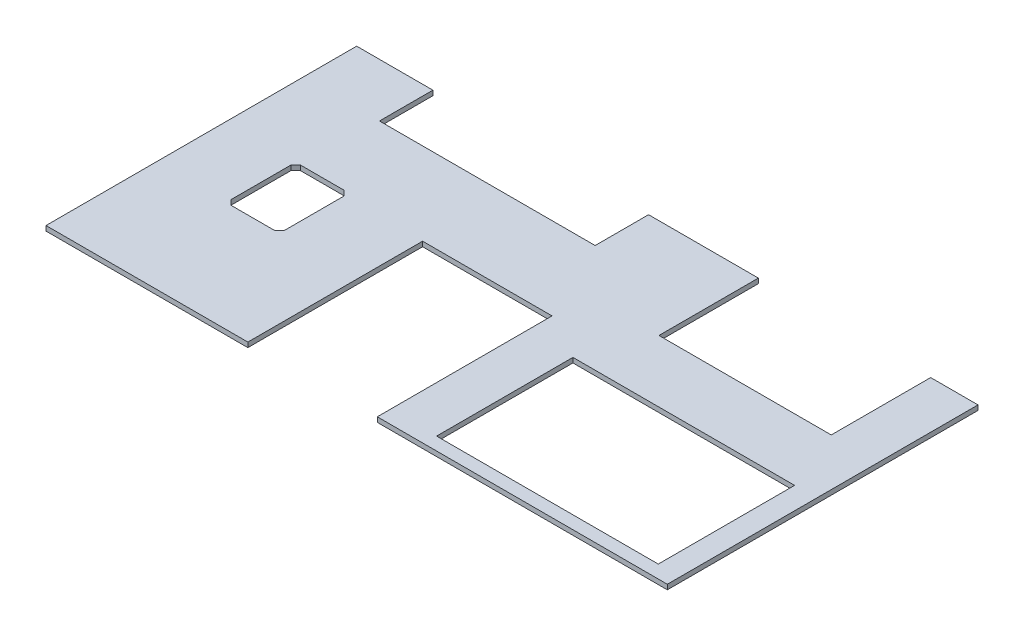
ISO-10303-21;
HEADER;
FILE_DESCRIPTION(('STEP AP214'),'2;1');
FILE_NAME('part.step','',(''),(''),'','','');
FILE_SCHEMA(('AUTOMOTIVE_DESIGN { 1 0 10303 214 1 1 1 1 }'));
ENDSEC;
DATA;
#1=APPLICATION_CONTEXT('core data for automotive mechanical design processes');
#2=APPLICATION_PROTOCOL_DEFINITION('international standard','automotive_design',2000,#1);
#3=PRODUCT_CONTEXT('',#1,'mechanical');
#4=PRODUCT('Part','Part','',(#3));
#5=PRODUCT_RELATED_PRODUCT_CATEGORY('part','',(#4));
#6=PRODUCT_DEFINITION_FORMATION('','',#4);
#7=PRODUCT_DEFINITION_CONTEXT('part definition',#1,'design');
#8=PRODUCT_DEFINITION('design','',#6,#7);
#9=PRODUCT_DEFINITION_SHAPE('','',#8);
#10=(LENGTH_UNIT() NAMED_UNIT(*) SI_UNIT(.MILLI.,.METRE.));
#11=(NAMED_UNIT(*) PLANE_ANGLE_UNIT() SI_UNIT($,.RADIAN.));
#12=(NAMED_UNIT(*) SI_UNIT($,.STERADIAN.) SOLID_ANGLE_UNIT());
#13=UNCERTAINTY_MEASURE_WITH_UNIT(LENGTH_MEASURE(1.E-05),#10,'distance_accuracy_value','');
#14=(GEOMETRIC_REPRESENTATION_CONTEXT(3) GLOBAL_UNCERTAINTY_ASSIGNED_CONTEXT((#13)) GLOBAL_UNIT_ASSIGNED_CONTEXT((#10,
#11,#12)) REPRESENTATION_CONTEXT('',''));
#15=CARTESIAN_POINT('',(0.,0.,0.));
#16=DIRECTION('',(0.,0.,1.));
#17=DIRECTION('',(1.,0.,0.));
#18=AXIS2_PLACEMENT_3D('',#15,#16,#17);
#19=CARTESIAN_POINT('',(2438.4,-19.05,-1219.2));
#20=DIRECTION('',(0.,0.,-1.));
#21=DIRECTION('',(-1.,0.,0.));
#22=AXIS2_PLACEMENT_3D('',#19,#20,#21);
#23=PLANE('',#22);
#24=DIRECTION('',(0.,1.,0.));
#25=VECTOR('',#24,1.);
#26=CARTESIAN_POINT('',(299.1104,-19.05,-1219.2));
#27=LINE('',#26,#25);
#28=CARTESIAN_POINT('',(299.1104,-19.05,-1219.2));
#29=VERTEX_POINT('',#28);
#30=CARTESIAN_POINT('',(299.1104,0.,-1219.2));
#31=VERTEX_POINT('',#30);
#32=EDGE_CURVE('E320',#29,#31,#27,.T.);
#33=ORIENTED_EDGE('',*,*,#32,.F.);
#34=DIRECTION('',(-1.,0.,0.));
#35=VECTOR('',#34,1.);
#36=CARTESIAN_POINT('',(2438.4,-19.05,-1219.2));
#37=LINE('',#36,#35);
#38=CARTESIAN_POINT('',(0.,-19.05,-1219.2));
#39=VERTEX_POINT('',#38);
#40=EDGE_CURVE('E231',#29,#39,#37,.T.);
#41=ORIENTED_EDGE('',*,*,#40,.T.);
#42=DIRECTION('',(0.,1.,0.));
#43=VECTOR('',#42,1.);
#44=CARTESIAN_POINT('',(0.,-19.05,-1219.2));
#45=LINE('',#44,#43);
#46=CARTESIAN_POINT('',(0.,0.,-1219.2));
#47=VERTEX_POINT('',#46);
#48=EDGE_CURVE('E436',#39,#47,#45,.T.);
#49=ORIENTED_EDGE('',*,*,#48,.T.);
#50=DIRECTION('',(-1.,0.,0.));
#51=VECTOR('',#50,1.);
#52=CARTESIAN_POINT('',(2438.4,0.,-1219.2));
#53=LINE('',#52,#51);
#54=EDGE_CURVE('E427',#31,#47,#53,.T.);
#55=ORIENTED_EDGE('',*,*,#54,.F.);
#56=EDGE_LOOP('',(#33,#41,#49,#55));
#57=FACE_BOUND('',#56,.T.);
#58=ADVANCED_FACE('F40',(#57),#23,.T.);
#59=DIRECTION('',(0.,-1.,0.));
#60=VECTOR('',#59,1.);
#61=CARTESIAN_POINT('',(2252.62694,-19.05,-1219.2));
#62=LINE('',#61,#60);
#63=CARTESIAN_POINT('',(2252.62694,0.,-1219.2));
#64=VERTEX_POINT('',#63);
#65=CARTESIAN_POINT('',(2252.62694,-19.05,-1219.2));
#66=VERTEX_POINT('',#65);
#67=EDGE_CURVE('E345',#64,#66,#62,.T.);
#68=ORIENTED_EDGE('',*,*,#67,.F.);
#69=CARTESIAN_POINT('',(2438.4,0.,-1219.2));
#70=VERTEX_POINT('',#69);
#71=EDGE_CURVE('E428',#70,#64,#53,.T.);
#72=ORIENTED_EDGE('',*,*,#71,.F.);
#73=DIRECTION('',(0.,1.,0.));
#74=VECTOR('',#73,1.);
#75=CARTESIAN_POINT('',(2438.4,-19.05,-1219.2));
#76=LINE('',#75,#74);
#77=CARTESIAN_POINT('',(2438.4,-19.05,-1219.2));
#78=VERTEX_POINT('',#77);
#79=EDGE_CURVE('E439',#78,#70,#76,.T.);
#80=ORIENTED_EDGE('',*,*,#79,.F.);
#81=EDGE_CURVE('E413',#78,#66,#37,.T.);
#82=ORIENTED_EDGE('',*,*,#81,.T.);
#83=EDGE_LOOP('',(#68,#72,#80,#82));
#84=FACE_BOUND('',#83,.T.);
#85=ADVANCED_FACE('F465',(#84),#23,.T.);
#86=CARTESIAN_POINT('',(0.,-19.05,0.));
#87=DIRECTION('',(0.,0.,1.));
#88=DIRECTION('',(1.,0.,0.));
#89=AXIS2_PLACEMENT_3D('',#86,#87,#88);
#90=PLANE('',#89);
#91=DIRECTION('',(0.,1.,0.));
#92=VECTOR('',#91,1.);
#93=CARTESIAN_POINT('',(792.1625,-19.05,0.));
#94=LINE('',#93,#92);
#95=CARTESIAN_POINT('',(792.1625,-19.05,0.));
#96=VERTEX_POINT('',#95);
#97=CARTESIAN_POINT('',(792.1625,0.,0.));
#98=VERTEX_POINT('',#97);
#99=EDGE_CURVE('E358',#96,#98,#94,.T.);
#100=ORIENTED_EDGE('',*,*,#99,.T.);
#101=DIRECTION('',(1.,0.,0.));
#102=VECTOR('',#101,1.);
#103=CARTESIAN_POINT('',(0.,0.,0.));
#104=LINE('',#103,#102);
#105=CARTESIAN_POINT('',(0.,0.,0.));
#106=VERTEX_POINT('',#105);
#107=EDGE_CURVE('E421',#106,#98,#104,.T.);
#108=ORIENTED_EDGE('',*,*,#107,.F.);
#109=DIRECTION('',(0.,1.,0.));
#110=VECTOR('',#109,1.);
#111=CARTESIAN_POINT('',(0.,-19.05,0.));
#112=LINE('',#111,#110);
#113=CARTESIAN_POINT('',(0.,-19.05,0.));
#114=VERTEX_POINT('',#113);
#115=EDGE_CURVE('E48',#114,#106,#112,.T.);
#116=ORIENTED_EDGE('',*,*,#115,.F.);
#117=DIRECTION('',(1.,0.,0.));
#118=VECTOR('',#117,1.);
#119=CARTESIAN_POINT('',(0.,-19.05,0.));
#120=LINE('',#119,#118);
#121=EDGE_CURVE('E406',#114,#96,#120,.T.);
#122=ORIENTED_EDGE('',*,*,#121,.T.);
#123=EDGE_LOOP('',(#100,#108,#116,#122));
#124=FACE_BOUND('',#123,.T.);
#125=ADVANCED_FACE('F491',(#124),#90,.T.);
#126=DIRECTION('',(0.,1.,0.));
#127=VECTOR('',#126,1.);
#128=CARTESIAN_POINT('',(1300.1625,-19.05,0.));
#129=LINE('',#128,#127);
#130=CARTESIAN_POINT('',(1300.1625,-19.05,0.));
#131=VERTEX_POINT('',#130);
#132=CARTESIAN_POINT('',(1300.1625,0.,0.));
#133=VERTEX_POINT('',#132);
#134=EDGE_CURVE('E370',#131,#133,#129,.T.);
#135=ORIENTED_EDGE('',*,*,#134,.F.);
#136=CARTESIAN_POINT('',(2438.4,-19.05,0.));
#137=VERTEX_POINT('',#136);
#138=EDGE_CURVE('E410',#131,#137,#120,.T.);
#139=ORIENTED_EDGE('',*,*,#138,.T.);
#140=DIRECTION('',(0.,1.,0.));
#141=VECTOR('',#140,1.);
#142=CARTESIAN_POINT('',(2438.4,-19.05,0.));
#143=LINE('',#142,#141);
#144=CARTESIAN_POINT('',(2438.4,0.,0.));
#145=VERTEX_POINT('',#144);
#146=EDGE_CURVE('E420',#137,#145,#143,.T.);
#147=ORIENTED_EDGE('',*,*,#146,.T.);
#148=EDGE_CURVE('E399',#133,#145,#104,.T.);
#149=ORIENTED_EDGE('',*,*,#148,.F.);
#150=EDGE_LOOP('',(#135,#139,#147,#149));
#151=FACE_BOUND('',#150,.T.);
#152=ADVANCED_FACE('F42',(#151),#90,.T.);
#153=CARTESIAN_POINT('',(0.,-19.05,-1219.2));
#154=DIRECTION('',(-1.,0.,0.));
#155=DIRECTION('',(0.,0.,1.));
#156=AXIS2_PLACEMENT_3D('',#153,#154,#155);
#157=PLANE('',#156);
#158=DIRECTION('',(0.,0.,1.));
#159=VECTOR('',#158,1.);
#160=CARTESIAN_POINT('',(0.,0.,-1219.2));
#161=LINE('',#160,#159);
#162=EDGE_CURVE('E431',#47,#106,#161,.T.);
#163=ORIENTED_EDGE('',*,*,#162,.F.);
#164=ORIENTED_EDGE('',*,*,#48,.F.);
#165=DIRECTION('',(0.,0.,1.));
#166=VECTOR('',#165,1.);
#167=CARTESIAN_POINT('',(0.,-19.05,-1219.2));
#168=LINE('',#167,#166);
#169=EDGE_CURVE('E416',#39,#114,#168,.T.);
#170=ORIENTED_EDGE('',*,*,#169,.T.);
#171=ORIENTED_EDGE('',*,*,#115,.T.);
#172=EDGE_LOOP('',(#163,#164,#170,#171));
#173=FACE_BOUND('',#172,.T.);
#174=ADVANCED_FACE('F487',(#173),#157,.T.);
#175=DIRECTION('',(0.,1.,0.));
#176=VECTOR('',#175,1.);
#177=CARTESIAN_POINT('',(1145.54,-19.05,-1219.2));
#178=LINE('',#177,#176);
#179=CARTESIAN_POINT('',(1145.54,-19.05,-1219.2));
#180=VERTEX_POINT('',#179);
#181=CARTESIAN_POINT('',(1145.54,0.,-1219.2));
#182=VERTEX_POINT('',#181);
#183=EDGE_CURVE('E317',#180,#182,#178,.T.);
#184=ORIENTED_EDGE('',*,*,#183,.T.);
#185=CARTESIAN_POINT('',(1576.4256,0.,-1219.2));
#186=VERTEX_POINT('',#185);
#187=EDGE_CURVE('E432',#186,#182,#53,.T.);
#188=ORIENTED_EDGE('',*,*,#187,.F.);
#189=DIRECTION('',(0.,1.,0.));
#190=VECTOR('',#189,1.);
#191=CARTESIAN_POINT('',(1576.4256,-19.05,-1219.2));
#192=LINE('',#191,#190);
#193=CARTESIAN_POINT('',(1576.4256,-19.05,-1219.2));
#194=VERTEX_POINT('',#193);
#195=EDGE_CURVE('E341',#194,#186,#192,.T.);
#196=ORIENTED_EDGE('',*,*,#195,.F.);
#197=EDGE_CURVE('E417',#194,#180,#37,.T.);
#198=ORIENTED_EDGE('',*,*,#197,.T.);
#199=EDGE_LOOP('',(#184,#188,#196,#198));
#200=FACE_BOUND('',#199,.T.);
#201=ADVANCED_FACE('F481',(#200),#23,.T.);
#202=CARTESIAN_POINT('',(2438.4,-19.05,0.));
#203=DIRECTION('',(1.,0.,0.));
#204=DIRECTION('',(0.,0.,-1.));
#205=AXIS2_PLACEMENT_3D('',#202,#203,#204);
#206=PLANE('',#205);
#207=DIRECTION('',(0.,0.,-1.));
#208=VECTOR('',#207,1.);
#209=CARTESIAN_POINT('',(2438.4,0.,0.));
#210=LINE('',#209,#208);
#211=EDGE_CURVE('E424',#145,#70,#210,.T.);
#212=ORIENTED_EDGE('',*,*,#211,.F.);
#213=ORIENTED_EDGE('',*,*,#146,.F.);
#214=DIRECTION('',(0.,0.,-1.));
#215=VECTOR('',#214,1.);
#216=CARTESIAN_POINT('',(2438.4,-19.05,0.));
#217=LINE('',#216,#215);
#218=EDGE_CURVE('E409',#137,#78,#217,.T.);
#219=ORIENTED_EDGE('',*,*,#218,.T.);
#220=ORIENTED_EDGE('',*,*,#79,.T.);
#221=EDGE_LOOP('',(#212,#213,#219,#220));
#222=FACE_BOUND('',#221,.T.);
#223=ADVANCED_FACE('F449',(#222),#206,.T.);
#224=CARTESIAN_POINT('',(0.,-19.05,0.));
#225=DIRECTION('',(0.,1.,0.));
#226=DIRECTION('',(0.,0.,1.));
#227=AXIS2_PLACEMENT_3D('',#224,#225,#226);
#228=PLANE('',#227);
#229=DIRECTION('',(1.,0.,0.));
#230=VECTOR('',#229,1.);
#231=CARTESIAN_POINT('',(294.0685,-19.05,-431.8));
#232=LINE('',#231,#230);
#233=CARTESIAN_POINT('',(294.0685,-19.05,-431.8));
#234=VERTEX_POINT('',#233);
#235=CARTESIAN_POINT('',(465.5185,-19.05,-431.8));
#236=VERTEX_POINT('',#235);
#237=EDGE_CURVE('E276',#234,#236,#232,.T.);
#238=ORIENTED_EDGE('',*,*,#237,.T.);
#239=DIRECTION('',(0.707106781186545,0.,-0.70710678118655));
#240=VECTOR('',#239,1.);
#241=CARTESIAN_POINT('',(465.5185,-19.05,-431.8));
#242=LINE('',#241,#240);
#243=CARTESIAN_POINT('',(484.5685,-19.05,-450.85));
#244=VERTEX_POINT('',#243);
#245=EDGE_CURVE('E256',#236,#244,#242,.T.);
#246=ORIENTED_EDGE('',*,*,#245,.T.);
#247=DIRECTION('',(0.,0.,-1.));
#248=VECTOR('',#247,1.);
#249=CARTESIAN_POINT('',(484.5685,-19.05,-685.8));
#250=LINE('',#249,#248);
#251=CARTESIAN_POINT('',(484.5685,-19.05,-685.8));
#252=VERTEX_POINT('',#251);
#253=EDGE_CURVE('E259',#244,#252,#250,.T.);
#254=ORIENTED_EDGE('',*,*,#253,.T.);
#255=DIRECTION('',(-0.707106781186548,0.,-0.707106781186548));
#256=VECTOR('',#255,1.);
#257=CARTESIAN_POINT('',(465.5185,-19.05,-704.85));
#258=LINE('',#257,#256);
#259=CARTESIAN_POINT('',(465.5185,-19.05,-704.85));
#260=VERTEX_POINT('',#259);
#261=EDGE_CURVE('E55',#252,#260,#258,.T.);
#262=ORIENTED_EDGE('',*,*,#261,.T.);
#263=DIRECTION('',(-1.,0.,0.));
#264=VECTOR('',#263,1.);
#265=CARTESIAN_POINT('',(294.0685,-19.05,-704.85));
#266=LINE('',#265,#264);
#267=CARTESIAN_POINT('',(294.0685,-19.05,-704.85));
#268=VERTEX_POINT('',#267);
#269=EDGE_CURVE('E264',#260,#268,#266,.T.);
#270=ORIENTED_EDGE('',*,*,#269,.T.);
#271=DIRECTION('',(-0.707106781186548,0.,0.707106781186548));
#272=VECTOR('',#271,1.);
#273=CARTESIAN_POINT('',(294.0685,-19.05,-704.85));
#274=LINE('',#273,#272);
#275=CARTESIAN_POINT('',(275.0185,-19.05,-685.8));
#276=VERTEX_POINT('',#275);
#277=EDGE_CURVE('E267',#268,#276,#274,.T.);
#278=ORIENTED_EDGE('',*,*,#277,.T.);
#279=DIRECTION('',(0.,0.,1.));
#280=VECTOR('',#279,1.);
#281=CARTESIAN_POINT('',(275.0185,-19.05,-685.8));
#282=LINE('',#281,#280);
#283=CARTESIAN_POINT('',(275.0185,-19.05,-450.85));
#284=VERTEX_POINT('',#283);
#285=EDGE_CURVE('E270',#276,#284,#282,.T.);
#286=ORIENTED_EDGE('',*,*,#285,.T.);
#287=DIRECTION('',(0.707106781186546,0.,0.707106781186548));
#288=VECTOR('',#287,1.);
#289=CARTESIAN_POINT('',(294.0685,-19.05,-431.8));
#290=LINE('',#289,#288);
#291=EDGE_CURVE('E273',#284,#234,#290,.T.);
#292=ORIENTED_EDGE('',*,*,#291,.T.);
#293=EDGE_LOOP('',(#238,#246,#254,#262,#270,#278,#286,#292));
#294=FACE_BOUND('',#293,.T.);
#295=DIRECTION('',(-1.,0.,0.));
#296=VECTOR('',#295,1.);
#297=CARTESIAN_POINT('',(1360.29339547829,-19.05,-1005.29320167546));
#298=LINE('',#297,#296);
#299=CARTESIAN_POINT('',(1145.54,-19.05,-1005.29320167546));
#300=VERTEX_POINT('',#299);
#301=CARTESIAN_POINT('',(299.1104,-19.05,-1005.29320167546));
#302=VERTEX_POINT('',#301);
#303=EDGE_CURVE('E229',#300,#302,#298,.T.);
#304=ORIENTED_EDGE('',*,*,#303,.F.);
#305=DIRECTION('',(0.,0.,-1.));
#306=VECTOR('',#305,1.);
#307=CARTESIAN_POINT('',(1145.54,-19.05,-1219.2));
#308=LINE('',#307,#306);
#309=EDGE_CURVE('E235',#300,#180,#308,.T.);
#310=ORIENTED_EDGE('',*,*,#309,.T.);
#311=ORIENTED_EDGE('',*,*,#197,.F.);
#312=DIRECTION('',(0.,0.,1.));
#313=VECTOR('',#312,1.);
#314=CARTESIAN_POINT('',(1576.4256,-19.05,-1692.91));
#315=LINE('',#314,#313);
#316=CARTESIAN_POINT('',(1576.4256,-19.05,-829.05854));
#317=VERTEX_POINT('',#316);
#318=EDGE_CURVE('E328',#194,#317,#315,.T.);
#319=ORIENTED_EDGE('',*,*,#318,.T.);
#320=DIRECTION('',(1.,0.,0.));
#321=VECTOR('',#320,1.);
#322=CARTESIAN_POINT('',(1576.4256,-19.05,-829.05854));
#323=LINE('',#322,#321);
#324=CARTESIAN_POINT('',(2252.62694,-19.05,-829.05854));
#325=VERTEX_POINT('',#324);
#326=EDGE_CURVE('E332',#317,#325,#323,.T.);
#327=ORIENTED_EDGE('',*,*,#326,.T.);
#328=DIRECTION('',(0.,0.,-1.));
#329=VECTOR('',#328,1.);
#330=CARTESIAN_POINT('',(2252.62694,-19.05,-1692.91));
#331=LINE('',#330,#329);
#332=EDGE_CURVE('E325',#325,#66,#331,.T.);
#333=ORIENTED_EDGE('',*,*,#332,.T.);
#334=ORIENTED_EDGE('',*,*,#81,.F.);
#335=ORIENTED_EDGE('',*,*,#218,.F.);
#336=ORIENTED_EDGE('',*,*,#138,.F.);
#337=DIRECTION('',(0.,0.,-1.));
#338=VECTOR('',#337,1.);
#339=CARTESIAN_POINT('',(1300.1625,-19.05,-685.8));
#340=LINE('',#339,#338);
#341=CARTESIAN_POINT('',(1300.1625,-19.05,-685.8));
#342=VERTEX_POINT('',#341);
#343=EDGE_CURVE('E351',#131,#342,#340,.T.);
#344=ORIENTED_EDGE('',*,*,#343,.T.);
#345=DIRECTION('',(-1.,0.,0.));
#346=VECTOR('',#345,1.);
#347=CARTESIAN_POINT('',(792.1625,-19.05,-685.8));
#348=LINE('',#347,#346);
#349=CARTESIAN_POINT('',(792.1625,-19.05,-685.8));
#350=VERTEX_POINT('',#349);
#351=EDGE_CURVE('E355',#342,#350,#348,.T.);
#352=ORIENTED_EDGE('',*,*,#351,.T.);
#353=DIRECTION('',(0.,0.,1.));
#354=VECTOR('',#353,1.);
#355=CARTESIAN_POINT('',(792.1625,-19.05,-685.8));
#356=LINE('',#355,#354);
#357=EDGE_CURVE('E348',#350,#96,#356,.T.);
#358=ORIENTED_EDGE('',*,*,#357,.T.);
#359=ORIENTED_EDGE('',*,*,#121,.F.);
#360=ORIENTED_EDGE('',*,*,#169,.F.);
#361=ORIENTED_EDGE('',*,*,#40,.F.);
#362=DIRECTION('',(0.,0.,1.));
#363=VECTOR('',#362,1.);
#364=CARTESIAN_POINT('',(299.1104,-19.05,-1219.2));
#365=LINE('',#364,#363);
#366=EDGE_CURVE('E224',#29,#302,#365,.T.);
#367=ORIENTED_EDGE('',*,*,#366,.T.);
#368=EDGE_LOOP('',(#304,#310,#311,#319,#327,#333,#334,#335,#336,#344,#352,#358,#359,#360,#361,#367));
#369=FACE_BOUND('',#368,.T.);
#370=DIRECTION('',(1.,0.,0.));
#371=VECTOR('',#370,1.);
#372=CARTESIAN_POINT('',(1482.09,-19.05,-50.8));
#373=LINE('',#372,#371);
#374=CARTESIAN_POINT('',(1482.09,-19.05,-50.8));
#375=VERTEX_POINT('',#374);
#376=CARTESIAN_POINT('',(2352.04,-19.05,-50.8));
#377=VERTEX_POINT('',#376);
#378=EDGE_CURVE('E384',#375,#377,#373,.T.);
#379=ORIENTED_EDGE('',*,*,#378,.T.);
#380=DIRECTION('',(0.,0.,-1.));
#381=VECTOR('',#380,1.);
#382=CARTESIAN_POINT('',(2352.04,-19.05,-585.7875));
#383=LINE('',#382,#381);
#384=CARTESIAN_POINT('',(2352.04,-19.05,-585.7875));
#385=VERTEX_POINT('',#384);
#386=EDGE_CURVE('E374',#377,#385,#383,.T.);
#387=ORIENTED_EDGE('',*,*,#386,.T.);
#388=DIRECTION('',(-1.,0.,0.));
#389=VECTOR('',#388,1.);
#390=CARTESIAN_POINT('',(1482.09,-19.05,-585.7875));
#391=LINE('',#390,#389);
#392=CARTESIAN_POINT('',(1482.09,-19.05,-585.7875));
#393=VERTEX_POINT('',#392);
#394=EDGE_CURVE('E377',#385,#393,#391,.T.);
#395=ORIENTED_EDGE('',*,*,#394,.T.);
#396=DIRECTION('',(0.,0.,1.));
#397=VECTOR('',#396,1.);
#398=CARTESIAN_POINT('',(1482.09,-19.05,-585.7875));
#399=LINE('',#398,#397);
#400=EDGE_CURVE('E381',#393,#375,#399,.T.);
#401=ORIENTED_EDGE('',*,*,#400,.T.);
#402=EDGE_LOOP('',(#379,#387,#395,#401));
#403=FACE_BOUND('',#402,.T.);
#404=ADVANCED_FACE('F226',(#294,#369,#403),#228,.F.);
#405=CARTESIAN_POINT('',(0.,0.,0.));
#406=DIRECTION('',(0.,1.,0.));
#407=DIRECTION('',(0.,0.,1.));
#408=AXIS2_PLACEMENT_3D('',#405,#406,#407);
#409=PLANE('',#408);
#410=DIRECTION('',(0.,0.,-1.));
#411=VECTOR('',#410,1.);
#412=CARTESIAN_POINT('',(1145.54,0.,-1219.2));
#413=LINE('',#412,#411);
#414=CARTESIAN_POINT('',(1145.54,0.,-1009.60175484405));
#415=VERTEX_POINT('',#414);
#416=EDGE_CURVE('E236',#415,#182,#413,.T.);
#417=ORIENTED_EDGE('',*,*,#416,.F.);
#418=DIRECTION('',(-1.,0.,0.));
#419=VECTOR('',#418,1.);
#420=CARTESIAN_POINT('',(1360.29339547829,0.,-1009.60175484405));
#421=LINE('',#420,#419);
#422=CARTESIAN_POINT('',(299.1104,0.,-1009.60175484405));
#423=VERTEX_POINT('',#422);
#424=EDGE_CURVE('E253',#415,#423,#421,.T.);
#425=ORIENTED_EDGE('',*,*,#424,.T.);
#426=DIRECTION('',(0.,0.,1.));
#427=VECTOR('',#426,1.);
#428=CARTESIAN_POINT('',(299.1104,0.,-1219.2));
#429=LINE('',#428,#427);
#430=EDGE_CURVE('E250',#31,#423,#429,.T.);
#431=ORIENTED_EDGE('',*,*,#430,.F.);
#432=ORIENTED_EDGE('',*,*,#54,.T.);
#433=ORIENTED_EDGE('',*,*,#162,.T.);
#434=ORIENTED_EDGE('',*,*,#107,.T.);
#435=DIRECTION('',(0.,0.,1.));
#436=VECTOR('',#435,1.);
#437=CARTESIAN_POINT('',(792.1625,0.,-685.8));
#438=LINE('',#437,#436);
#439=CARTESIAN_POINT('',(792.1625,0.,-685.8));
#440=VERTEX_POINT('',#439);
#441=EDGE_CURVE('E347',#440,#98,#438,.T.);
#442=ORIENTED_EDGE('',*,*,#441,.F.);
#443=DIRECTION('',(-1.,0.,0.));
#444=VECTOR('',#443,1.);
#445=CARTESIAN_POINT('',(792.1625,0.,-685.8));
#446=LINE('',#445,#444);
#447=CARTESIAN_POINT('',(1300.1625,0.,-685.8));
#448=VERTEX_POINT('',#447);
#449=EDGE_CURVE('E352',#448,#440,#446,.T.);
#450=ORIENTED_EDGE('',*,*,#449,.F.);
#451=DIRECTION('',(0.,0.,-1.));
#452=VECTOR('',#451,1.);
#453=CARTESIAN_POINT('',(1300.1625,0.,-685.8));
#454=LINE('',#453,#452);
#455=EDGE_CURVE('E360',#133,#448,#454,.T.);
#456=ORIENTED_EDGE('',*,*,#455,.F.);
#457=ORIENTED_EDGE('',*,*,#148,.T.);
#458=ORIENTED_EDGE('',*,*,#211,.T.);
#459=ORIENTED_EDGE('',*,*,#71,.T.);
#460=DIRECTION('',(0.,0.,-1.));
#461=VECTOR('',#460,1.);
#462=CARTESIAN_POINT('',(2252.62694,0.,-1692.91));
#463=LINE('',#462,#461);
#464=CARTESIAN_POINT('',(2252.62694,0.,-829.05854));
#465=VERTEX_POINT('',#464);
#466=EDGE_CURVE('E322',#465,#64,#463,.T.);
#467=ORIENTED_EDGE('',*,*,#466,.F.);
#468=DIRECTION('',(1.,0.,0.));
#469=VECTOR('',#468,1.);
#470=CARTESIAN_POINT('',(1576.4256,0.,-829.05854));
#471=LINE('',#470,#469);
#472=CARTESIAN_POINT('',(1576.4256,0.,-829.05854));
#473=VERTEX_POINT('',#472);
#474=EDGE_CURVE('E329',#473,#465,#471,.T.);
#475=ORIENTED_EDGE('',*,*,#474,.F.);
#476=DIRECTION('',(0.,0.,1.));
#477=VECTOR('',#476,1.);
#478=CARTESIAN_POINT('',(1576.4256,0.,0.));
#479=LINE('',#478,#477);
#480=EDGE_CURVE('E11',#186,#473,#479,.T.);
#481=ORIENTED_EDGE('',*,*,#480,.F.);
#482=ORIENTED_EDGE('',*,*,#187,.T.);
#483=EDGE_LOOP('',(#417,#425,#431,#432,#433,#434,#442,#450,#456,#457,#458,#459,#467,#475,#481,#482));
#484=FACE_BOUND('',#483,.T.);
#485=DIRECTION('',(0.707106781186545,0.,-0.70710678118655));
#486=VECTOR('',#485,1.);
#487=CARTESIAN_POINT('',(465.5185,0.,-431.8));
#488=LINE('',#487,#486);
#489=CARTESIAN_POINT('',(465.5185,0.,-431.8));
#490=VERTEX_POINT('',#489);
#491=CARTESIAN_POINT('',(484.5685,0.,-450.85));
#492=VERTEX_POINT('',#491);
#493=EDGE_CURVE('E63',#490,#492,#488,.T.);
#494=ORIENTED_EDGE('',*,*,#493,.F.);
#495=DIRECTION('',(1.,0.,0.));
#496=VECTOR('',#495,1.);
#497=CARTESIAN_POINT('',(294.0685,0.,-431.8));
#498=LINE('',#497,#496);
#499=CARTESIAN_POINT('',(294.0685,0.,-431.8));
#500=VERTEX_POINT('',#499);
#501=EDGE_CURVE('E260',#500,#490,#498,.T.);
#502=ORIENTED_EDGE('',*,*,#501,.F.);
#503=DIRECTION('',(0.707106781186546,0.,0.707106781186548));
#504=VECTOR('',#503,1.);
#505=CARTESIAN_POINT('',(294.0685,0.,-431.8));
#506=LINE('',#505,#504);
#507=CARTESIAN_POINT('',(275.0185,0.,-450.85));
#508=VERTEX_POINT('',#507);
#509=EDGE_CURVE('E296',#508,#500,#506,.T.);
#510=ORIENTED_EDGE('',*,*,#509,.F.);
#511=DIRECTION('',(0.,0.,1.));
#512=VECTOR('',#511,1.);
#513=CARTESIAN_POINT('',(275.0185,0.,-685.8));
#514=LINE('',#513,#512);
#515=CARTESIAN_POINT('',(275.0185,0.,-685.8));
#516=VERTEX_POINT('',#515);
#517=EDGE_CURVE('E293',#516,#508,#514,.T.);
#518=ORIENTED_EDGE('',*,*,#517,.F.);
#519=DIRECTION('',(-0.707106781186548,0.,0.707106781186548));
#520=VECTOR('',#519,1.);
#521=CARTESIAN_POINT('',(294.0685,0.,-704.85));
#522=LINE('',#521,#520);
#523=CARTESIAN_POINT('',(294.0685,0.,-704.85));
#524=VERTEX_POINT('',#523);
#525=EDGE_CURVE('E290',#524,#516,#522,.T.);
#526=ORIENTED_EDGE('',*,*,#525,.F.);
#527=DIRECTION('',(-1.,0.,0.));
#528=VECTOR('',#527,1.);
#529=CARTESIAN_POINT('',(294.0685,0.,-704.85));
#530=LINE('',#529,#528);
#531=CARTESIAN_POINT('',(465.5185,0.,-704.85));
#532=VERTEX_POINT('',#531);
#533=EDGE_CURVE('E287',#532,#524,#530,.T.);
#534=ORIENTED_EDGE('',*,*,#533,.F.);
#535=DIRECTION('',(-0.707106781186548,0.,-0.707106781186548));
#536=VECTOR('',#535,1.);
#537=CARTESIAN_POINT('',(465.5185,0.,-704.85));
#538=LINE('',#537,#536);
#539=CARTESIAN_POINT('',(484.5685,0.,-685.8));
#540=VERTEX_POINT('',#539);
#541=EDGE_CURVE('E284',#540,#532,#538,.T.);
#542=ORIENTED_EDGE('',*,*,#541,.F.);
#543=DIRECTION('',(0.,0.,-1.));
#544=VECTOR('',#543,1.);
#545=CARTESIAN_POINT('',(484.5685,0.,-685.8));
#546=LINE('',#545,#544);
#547=EDGE_CURVE('E281',#492,#540,#546,.T.);
#548=ORIENTED_EDGE('',*,*,#547,.F.);
#549=EDGE_LOOP('',(#494,#502,#510,#518,#526,#534,#542,#548));
#550=FACE_BOUND('',#549,.T.);
#551=DIRECTION('',(0.,0.,-1.));
#552=VECTOR('',#551,1.);
#553=CARTESIAN_POINT('',(2352.04,0.,-585.7875));
#554=LINE('',#553,#552);
#555=CARTESIAN_POINT('',(2352.04,0.,-50.8));
#556=VERTEX_POINT('',#555);
#557=CARTESIAN_POINT('',(2352.04,0.,-585.7875));
#558=VERTEX_POINT('',#557);
#559=EDGE_CURVE('E367',#556,#558,#554,.T.);
#560=ORIENTED_EDGE('',*,*,#559,.F.);
#561=DIRECTION('',(1.,0.,0.));
#562=VECTOR('',#561,1.);
#563=CARTESIAN_POINT('',(1482.09,0.,-50.8));
#564=LINE('',#563,#562);
#565=CARTESIAN_POINT('',(1482.09,0.,-50.8));
#566=VERTEX_POINT('',#565);
#567=EDGE_CURVE('E378',#566,#556,#564,.T.);
#568=ORIENTED_EDGE('',*,*,#567,.F.);
#569=DIRECTION('',(0.,0.,1.));
#570=VECTOR('',#569,1.);
#571=CARTESIAN_POINT('',(1482.09,0.,-585.7875));
#572=LINE('',#571,#570);
#573=CARTESIAN_POINT('',(1482.09,0.,-585.7875));
#574=VERTEX_POINT('',#573);
#575=EDGE_CURVE('E392',#574,#566,#572,.T.);
#576=ORIENTED_EDGE('',*,*,#575,.F.);
#577=DIRECTION('',(-1.,0.,0.));
#578=VECTOR('',#577,1.);
#579=CARTESIAN_POINT('',(1482.09,0.,-585.7875));
#580=LINE('',#579,#578);
#581=EDGE_CURVE('E389',#558,#574,#580,.T.);
#582=ORIENTED_EDGE('',*,*,#581,.F.);
#583=EDGE_LOOP('',(#560,#568,#576,#582));
#584=FACE_BOUND('',#583,.T.);
#585=ADVANCED_FACE('F452',(#484,#550,#584),#409,.T.);
#586=CARTESIAN_POINT('',(2352.04,-19.05,-585.7875));
#587=DIRECTION('',(1.,0.,0.));
#588=DIRECTION('',(0.,0.,-1.));
#589=AXIS2_PLACEMENT_3D('',#586,#587,#588);
#590=PLANE('',#589);
#591=ORIENTED_EDGE('',*,*,#559,.T.);
#592=DIRECTION('',(0.,1.,0.));
#593=VECTOR('',#592,1.);
#594=CARTESIAN_POINT('',(2352.04,-19.05,-585.7875));
#595=LINE('',#594,#593);
#596=EDGE_CURVE('E387',#385,#558,#595,.T.);
#597=ORIENTED_EDGE('',*,*,#596,.F.);
#598=ORIENTED_EDGE('',*,*,#386,.F.);
#599=DIRECTION('',(0.,1.,0.));
#600=VECTOR('',#599,1.);
#601=CARTESIAN_POINT('',(2352.04,-19.05,-50.8));
#602=LINE('',#601,#600);
#603=EDGE_CURVE('E397',#377,#556,#602,.T.);
#604=ORIENTED_EDGE('',*,*,#603,.T.);
#605=EDGE_LOOP('',(#591,#597,#598,#604));
#606=FACE_BOUND('',#605,.T.);
#607=ADVANCED_FACE('F524',(#606),#590,.F.);
#608=CARTESIAN_POINT('',(1482.09,-19.05,-50.8));
#609=DIRECTION('',(0.,0.,1.));
#610=DIRECTION('',(1.,0.,0.));
#611=AXIS2_PLACEMENT_3D('',#608,#609,#610);
#612=PLANE('',#611);
#613=ORIENTED_EDGE('',*,*,#567,.T.);
#614=ORIENTED_EDGE('',*,*,#603,.F.);
#615=ORIENTED_EDGE('',*,*,#378,.F.);
#616=DIRECTION('',(0.,1.,0.));
#617=VECTOR('',#616,1.);
#618=CARTESIAN_POINT('',(1482.09,-19.05,-50.8));
#619=LINE('',#618,#617);
#620=EDGE_CURVE('E400',#375,#566,#619,.T.);
#621=ORIENTED_EDGE('',*,*,#620,.T.);
#622=EDGE_LOOP('',(#613,#614,#615,#621));
#623=FACE_BOUND('',#622,.T.);
#624=ADVANCED_FACE('F530',(#623),#612,.F.);
#625=CARTESIAN_POINT('',(1482.09,-19.05,-585.7875));
#626=DIRECTION('',(-1.,0.,0.));
#627=DIRECTION('',(0.,0.,1.));
#628=AXIS2_PLACEMENT_3D('',#625,#626,#627);
#629=PLANE('',#628);
#630=ORIENTED_EDGE('',*,*,#575,.T.);
#631=ORIENTED_EDGE('',*,*,#620,.F.);
#632=ORIENTED_EDGE('',*,*,#400,.F.);
#633=DIRECTION('',(0.,1.,0.));
#634=VECTOR('',#633,1.);
#635=CARTESIAN_POINT('',(1482.09,-19.05,-585.7875));
#636=LINE('',#635,#634);
#637=EDGE_CURVE('E402',#393,#574,#636,.T.);
#638=ORIENTED_EDGE('',*,*,#637,.T.);
#639=EDGE_LOOP('',(#630,#631,#632,#638));
#640=FACE_BOUND('',#639,.T.);
#641=ADVANCED_FACE('F536',(#640),#629,.F.);
#642=CARTESIAN_POINT('',(1482.09,-19.05,-585.7875));
#643=DIRECTION('',(0.,0.,-1.));
#644=DIRECTION('',(-1.,0.,0.));
#645=AXIS2_PLACEMENT_3D('',#642,#643,#644);
#646=PLANE('',#645);
#647=ORIENTED_EDGE('',*,*,#581,.T.);
#648=ORIENTED_EDGE('',*,*,#637,.F.);
#649=ORIENTED_EDGE('',*,*,#394,.F.);
#650=ORIENTED_EDGE('',*,*,#596,.T.);
#651=EDGE_LOOP('',(#647,#648,#649,#650));
#652=FACE_BOUND('',#651,.T.);
#653=ADVANCED_FACE('F532',(#652),#646,.F.);
#654=CARTESIAN_POINT('',(792.1625,-19.05,-685.8));
#655=DIRECTION('',(-1.,0.,0.));
#656=DIRECTION('',(0.,0.,1.));
#657=AXIS2_PLACEMENT_3D('',#654,#655,#656);
#658=PLANE('',#657);
#659=ORIENTED_EDGE('',*,*,#441,.T.);
#660=ORIENTED_EDGE('',*,*,#99,.F.);
#661=ORIENTED_EDGE('',*,*,#357,.F.);
#662=DIRECTION('',(0.,1.,0.));
#663=VECTOR('',#662,1.);
#664=CARTESIAN_POINT('',(792.1625,-19.05,-685.8));
#665=LINE('',#664,#663);
#666=EDGE_CURVE('E365',#350,#440,#665,.T.);
#667=ORIENTED_EDGE('',*,*,#666,.T.);
#668=EDGE_LOOP('',(#659,#660,#661,#667));
#669=FACE_BOUND('',#668,.T.);
#670=ADVANCED_FACE('F535',(#669),#658,.F.);
#671=CARTESIAN_POINT('',(792.1625,-19.05,-685.8));
#672=DIRECTION('',(0.,0.,-1.));
#673=DIRECTION('',(-1.,0.,0.));
#674=AXIS2_PLACEMENT_3D('',#671,#672,#673);
#675=PLANE('',#674);
#676=ORIENTED_EDGE('',*,*,#449,.T.);
#677=ORIENTED_EDGE('',*,*,#666,.F.);
#678=ORIENTED_EDGE('',*,*,#351,.F.);
#679=DIRECTION('',(0.,1.,0.));
#680=VECTOR('',#679,1.);
#681=CARTESIAN_POINT('',(1300.1625,-19.05,-685.8));
#682=LINE('',#681,#680);
#683=EDGE_CURVE('E368',#342,#448,#682,.T.);
#684=ORIENTED_EDGE('',*,*,#683,.T.);
#685=EDGE_LOOP('',(#676,#677,#678,#684));
#686=FACE_BOUND('',#685,.T.);
#687=ADVANCED_FACE('F546',(#686),#675,.F.);
#688=CARTESIAN_POINT('',(1300.1625,-19.05,-685.8));
#689=DIRECTION('',(1.,0.,0.));
#690=DIRECTION('',(0.,0.,-1.));
#691=AXIS2_PLACEMENT_3D('',#688,#689,#690);
#692=PLANE('',#691);
#693=ORIENTED_EDGE('',*,*,#455,.T.);
#694=ORIENTED_EDGE('',*,*,#683,.F.);
#695=ORIENTED_EDGE('',*,*,#343,.F.);
#696=ORIENTED_EDGE('',*,*,#134,.T.);
#697=EDGE_LOOP('',(#693,#694,#695,#696));
#698=FACE_BOUND('',#697,.T.);
#699=ADVANCED_FACE('F459',(#698),#692,.F.);
#700=CARTESIAN_POINT('',(2252.62694,-19.05,-1692.91));
#701=DIRECTION('',(1.,0.,0.));
#702=DIRECTION('',(0.,0.,-1.));
#703=AXIS2_PLACEMENT_3D('',#700,#701,#702);
#704=PLANE('',#703);
#705=ORIENTED_EDGE('',*,*,#67,.T.);
#706=ORIENTED_EDGE('',*,*,#332,.F.);
#707=DIRECTION('',(0.,1.,0.));
#708=VECTOR('',#707,1.);
#709=CARTESIAN_POINT('',(2252.62694,-19.05,-829.05854));
#710=LINE('',#709,#708);
#711=EDGE_CURVE('E339',#325,#465,#710,.T.);
#712=ORIENTED_EDGE('',*,*,#711,.T.);
#713=ORIENTED_EDGE('',*,*,#466,.T.);
#714=EDGE_LOOP('',(#705,#706,#712,#713));
#715=FACE_BOUND('',#714,.T.);
#716=ADVANCED_FACE('F467',(#715),#704,.F.);
#717=CARTESIAN_POINT('',(1576.4256,-19.05,-829.05854));
#718=DIRECTION('',(0.,0.,1.));
#719=DIRECTION('',(1.,0.,0.));
#720=AXIS2_PLACEMENT_3D('',#717,#718,#719);
#721=PLANE('',#720);
#722=ORIENTED_EDGE('',*,*,#474,.T.);
#723=ORIENTED_EDGE('',*,*,#711,.F.);
#724=ORIENTED_EDGE('',*,*,#326,.F.);
#725=DIRECTION('',(0.,1.,0.));
#726=VECTOR('',#725,1.);
#727=CARTESIAN_POINT('',(1576.4256,-19.05,-829.05854));
#728=LINE('',#727,#726);
#729=EDGE_CURVE('E335',#317,#473,#728,.T.);
#730=ORIENTED_EDGE('',*,*,#729,.T.);
#731=EDGE_LOOP('',(#722,#723,#724,#730));
#732=FACE_BOUND('',#731,.T.);
#733=ADVANCED_FACE('F473',(#732),#721,.F.);
#734=CARTESIAN_POINT('',(1576.4256,-19.05,-1692.91));
#735=DIRECTION('',(-1.,0.,0.));
#736=DIRECTION('',(0.,0.,1.));
#737=AXIS2_PLACEMENT_3D('',#734,#735,#736);
#738=PLANE('',#737);
#739=ORIENTED_EDGE('',*,*,#195,.T.);
#740=ORIENTED_EDGE('',*,*,#480,.T.);
#741=ORIENTED_EDGE('',*,*,#729,.F.);
#742=ORIENTED_EDGE('',*,*,#318,.F.);
#743=EDGE_LOOP('',(#739,#740,#741,#742));
#744=FACE_BOUND('',#743,.T.);
#745=ADVANCED_FACE('F476',(#744),#738,.F.);
#746=CARTESIAN_POINT('',(299.1104,-19.05,-1219.2));
#747=DIRECTION('',(-1.,0.,0.));
#748=DIRECTION('',(0.,0.,1.));
#749=AXIS2_PLACEMENT_3D('',#746,#747,#748);
#750=PLANE('',#749);
#751=ORIENTED_EDGE('',*,*,#430,.T.);
#752=CARTESIAN_POINT('',(299.1104,-105.156000000007,-1430.27399999841));
#753=DIRECTION('',(-1.,0.,0.));
#754=DIRECTION('',(0.,0.,1.));
#755=AXIS2_PLACEMENT_3D('',#752,#753,#754);
#756=CIRCLE('',#755,433.6161);
#757=EDGE_CURVE('E243',#302,#423,#756,.T.);
#758=ORIENTED_EDGE('',*,*,#757,.F.);
#759=ORIENTED_EDGE('',*,*,#366,.F.);
#760=ORIENTED_EDGE('',*,*,#32,.T.);
#761=EDGE_LOOP('',(#751,#758,#759,#760));
#762=FACE_BOUND('',#761,.T.);
#763=ADVANCED_FACE('F248',(#762),#750,.F.);
#764=CARTESIAN_POINT('',(1145.54,-19.05,-1219.2));
#765=DIRECTION('',(1.,0.,0.));
#766=DIRECTION('',(0.,0.,-1.));
#767=AXIS2_PLACEMENT_3D('',#764,#765,#766);
#768=PLANE('',#767);
#769=ORIENTED_EDGE('',*,*,#416,.T.);
#770=ORIENTED_EDGE('',*,*,#183,.F.);
#771=ORIENTED_EDGE('',*,*,#309,.F.);
#772=CARTESIAN_POINT('',(1145.54,-105.156000000007,-1430.27399999841));
#773=DIRECTION('',(1.,0.,0.));
#774=DIRECTION('',(0.,0.,-1.));
#775=AXIS2_PLACEMENT_3D('',#772,#773,#774);
#776=CIRCLE('',#775,433.6161);
#777=EDGE_CURVE('E246',#300,#415,#776,.F.);
#778=ORIENTED_EDGE('',*,*,#777,.T.);
#779=EDGE_LOOP('',(#769,#770,#771,#778));
#780=FACE_BOUND('',#779,.T.);
#781=ADVANCED_FACE('F494',(#780),#768,.F.);
#782=CARTESIAN_POINT('',(465.5185,-19.05,-431.8));
#783=DIRECTION('',(0.70710678118655,0.,0.707106781186545));
#784=DIRECTION('',(0.707106781186545,0.,-0.70710678118655));
#785=AXIS2_PLACEMENT_3D('',#782,#783,#784);
#786=PLANE('',#785);
#787=ORIENTED_EDGE('',*,*,#493,.T.);
#788=DIRECTION('',(0.,1.,0.));
#789=VECTOR('',#788,1.);
#790=CARTESIAN_POINT('',(484.5685,-19.05,-450.85));
#791=LINE('',#790,#789);
#792=EDGE_CURVE('E279',#244,#492,#791,.T.);
#793=ORIENTED_EDGE('',*,*,#792,.F.);
#794=ORIENTED_EDGE('',*,*,#245,.F.);
#795=DIRECTION('',(0.,1.,0.));
#796=VECTOR('',#795,1.);
#797=CARTESIAN_POINT('',(465.5185,-19.05,-431.8));
#798=LINE('',#797,#796);
#799=EDGE_CURVE('E301',#236,#490,#798,.T.);
#800=ORIENTED_EDGE('',*,*,#799,.T.);
#801=EDGE_LOOP('',(#787,#793,#794,#800));
#802=FACE_BOUND('',#801,.T.);
#803=ADVANCED_FACE('F496',(#802),#786,.F.);
#804=CARTESIAN_POINT('',(294.0685,-19.05,-431.8));
#805=DIRECTION('',(0.,0.,1.));
#806=DIRECTION('',(1.,0.,0.));
#807=AXIS2_PLACEMENT_3D('',#804,#805,#806);
#808=PLANE('',#807);
#809=ORIENTED_EDGE('',*,*,#501,.T.);
#810=ORIENTED_EDGE('',*,*,#799,.F.);
#811=ORIENTED_EDGE('',*,*,#237,.F.);
#812=DIRECTION('',(0.,1.,0.));
#813=VECTOR('',#812,1.);
#814=CARTESIAN_POINT('',(294.0685,-19.05,-431.8));
#815=LINE('',#814,#813);
#816=EDGE_CURVE('E303',#234,#500,#815,.T.);
#817=ORIENTED_EDGE('',*,*,#816,.T.);
#818=EDGE_LOOP('',(#809,#810,#811,#817));
#819=FACE_BOUND('',#818,.T.);
#820=ADVANCED_FACE('F503',(#819),#808,.F.);
#821=CARTESIAN_POINT('',(294.0685,-19.05,-431.8));
#822=DIRECTION('',(-0.707106781186548,0.,0.707106781186546));
#823=DIRECTION('',(0.707106781186547,0.,0.707106781186549));
#824=AXIS2_PLACEMENT_3D('',#821,#822,#823);
#825=PLANE('',#824);
#826=ORIENTED_EDGE('',*,*,#509,.T.);
#827=ORIENTED_EDGE('',*,*,#816,.F.);
#828=ORIENTED_EDGE('',*,*,#291,.F.);
#829=DIRECTION('',(0.,1.,0.));
#830=VECTOR('',#829,1.);
#831=CARTESIAN_POINT('',(275.0185,-19.05,-450.85));
#832=LINE('',#831,#830);
#833=EDGE_CURVE('E305',#284,#508,#832,.T.);
#834=ORIENTED_EDGE('',*,*,#833,.T.);
#835=EDGE_LOOP('',(#826,#827,#828,#834));
#836=FACE_BOUND('',#835,.T.);
#837=ADVANCED_FACE('F603',(#836),#825,.F.);
#838=CARTESIAN_POINT('',(275.0185,-19.05,-685.8));
#839=DIRECTION('',(-1.,0.,0.));
#840=DIRECTION('',(0.,0.,1.));
#841=AXIS2_PLACEMENT_3D('',#838,#839,#840);
#842=PLANE('',#841);
#843=ORIENTED_EDGE('',*,*,#517,.T.);
#844=ORIENTED_EDGE('',*,*,#833,.F.);
#845=ORIENTED_EDGE('',*,*,#285,.F.);
#846=DIRECTION('',(0.,1.,0.));
#847=VECTOR('',#846,1.);
#848=CARTESIAN_POINT('',(275.0185,-19.05,-685.8));
#849=LINE('',#848,#847);
#850=EDGE_CURVE('E307',#276,#516,#849,.T.);
#851=ORIENTED_EDGE('',*,*,#850,.T.);
#852=EDGE_LOOP('',(#843,#844,#845,#851));
#853=FACE_BOUND('',#852,.T.);
#854=ADVANCED_FACE('F613',(#853),#842,.F.);
#855=CARTESIAN_POINT('',(294.0685,-19.05,-704.85));
#856=DIRECTION('',(-0.707106781186548,0.,-0.707106781186548));
#857=DIRECTION('',(-0.707106781186548,0.,0.707106781186548));
#858=AXIS2_PLACEMENT_3D('',#855,#856,#857);
#859=PLANE('',#858);
#860=ORIENTED_EDGE('',*,*,#525,.T.);
#861=ORIENTED_EDGE('',*,*,#850,.F.);
#862=ORIENTED_EDGE('',*,*,#277,.F.);
#863=DIRECTION('',(0.,1.,0.));
#864=VECTOR('',#863,1.);
#865=CARTESIAN_POINT('',(294.0685,-19.05,-704.85));
#866=LINE('',#865,#864);
#867=EDGE_CURVE('E309',#268,#524,#866,.T.);
#868=ORIENTED_EDGE('',*,*,#867,.T.);
#869=EDGE_LOOP('',(#860,#861,#862,#868));
#870=FACE_BOUND('',#869,.T.);
#871=ADVANCED_FACE('F623',(#870),#859,.F.);
#872=CARTESIAN_POINT('',(294.0685,-19.05,-704.85));
#873=DIRECTION('',(0.,0.,-1.));
#874=DIRECTION('',(-1.,0.,0.));
#875=AXIS2_PLACEMENT_3D('',#872,#873,#874);
#876=PLANE('',#875);
#877=ORIENTED_EDGE('',*,*,#533,.T.);
#878=ORIENTED_EDGE('',*,*,#867,.F.);
#879=ORIENTED_EDGE('',*,*,#269,.F.);
#880=DIRECTION('',(0.,1.,0.));
#881=VECTOR('',#880,1.);
#882=CARTESIAN_POINT('',(465.5185,-19.05,-704.85));
#883=LINE('',#882,#881);
#884=EDGE_CURVE('E311',#260,#532,#883,.T.);
#885=ORIENTED_EDGE('',*,*,#884,.T.);
#886=EDGE_LOOP('',(#877,#878,#879,#885));
#887=FACE_BOUND('',#886,.T.);
#888=ADVANCED_FACE('F633',(#887),#876,.F.);
#889=CARTESIAN_POINT('',(465.5185,-19.05,-704.85));
#890=DIRECTION('',(0.707106781186548,0.,-0.707106781186548));
#891=DIRECTION('',(-0.707106781186548,0.,-0.707106781186548));
#892=AXIS2_PLACEMENT_3D('',#889,#890,#891);
#893=PLANE('',#892);
#894=ORIENTED_EDGE('',*,*,#541,.T.);
#895=ORIENTED_EDGE('',*,*,#884,.F.);
#896=ORIENTED_EDGE('',*,*,#261,.F.);
#897=DIRECTION('',(0.,1.,0.));
#898=VECTOR('',#897,1.);
#899=CARTESIAN_POINT('',(484.5685,-19.05,-685.8));
#900=LINE('',#899,#898);
#901=EDGE_CURVE('E313',#252,#540,#900,.T.);
#902=ORIENTED_EDGE('',*,*,#901,.T.);
#903=EDGE_LOOP('',(#894,#895,#896,#902));
#904=FACE_BOUND('',#903,.T.);
#905=ADVANCED_FACE('F643',(#904),#893,.F.);
#906=CARTESIAN_POINT('',(484.5685,-19.05,-685.8));
#907=DIRECTION('',(1.,0.,0.));
#908=DIRECTION('',(0.,0.,-1.));
#909=AXIS2_PLACEMENT_3D('',#906,#907,#908);
#910=PLANE('',#909);
#911=ORIENTED_EDGE('',*,*,#547,.T.);
#912=ORIENTED_EDGE('',*,*,#901,.F.);
#913=ORIENTED_EDGE('',*,*,#253,.F.);
#914=ORIENTED_EDGE('',*,*,#792,.T.);
#915=EDGE_LOOP('',(#911,#912,#913,#914));
#916=FACE_BOUND('',#915,.T.);
#917=ADVANCED_FACE('F652',(#916),#910,.F.);
#918=CARTESIAN_POINT('',(1360.29339547829,-105.156000000007,-1430.27399999841));
#919=DIRECTION('',(-1.,0.,0.));
#920=DIRECTION('',(0.,0.,1.));
#921=AXIS2_PLACEMENT_3D('',#918,#919,#920);
#922=CYLINDRICAL_SURFACE('',#921,433.6161);
#923=ORIENTED_EDGE('',*,*,#303,.T.);
#924=ORIENTED_EDGE('',*,*,#757,.T.);
#925=ORIENTED_EDGE('',*,*,#424,.F.);
#926=ORIENTED_EDGE('',*,*,#777,.F.);
#927=EDGE_LOOP('',(#923,#924,#925,#926));
#928=FACE_BOUND('',#927,.T.);
#929=ADVANCED_FACE('F241',(#928),#922,.F.);
#930=CLOSED_SHELL('',(#58,#85,#125,#152,#174,#201,#223,#404,#585,#607,#624,#641,#653,#670,#687,
#699,#716,#733,#745,#763,#781,#803,#820,#837,#854,#871,#888,#905,#917,#929));
#931=MANIFOLD_SOLID_BREP('B2',#930);
#932=ADVANCED_BREP_SHAPE_REPRESENTATION('',(#18,#931),#14);
#933=SHAPE_DEFINITION_REPRESENTATION(#9,#932);
ENDSEC;
END-ISO-10303-21;
